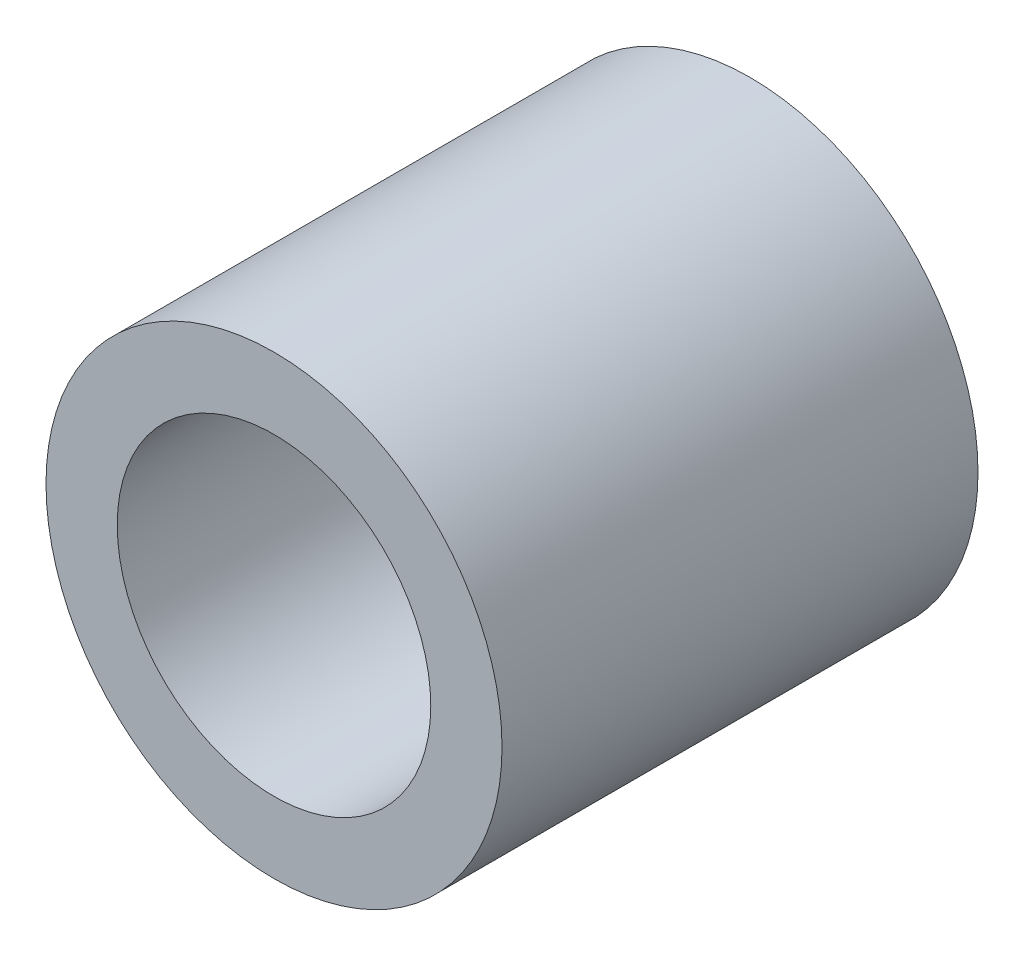
ISO-10303-21;
HEADER;
FILE_DESCRIPTION(('STEP AP214'),'2;1');
FILE_NAME('part.step','',(''),(''),'','','');
FILE_SCHEMA(('AUTOMOTIVE_DESIGN { 1 0 10303 214 1 1 1 1 }'));
ENDSEC;
DATA;
#1=APPLICATION_CONTEXT('core data for automotive mechanical design processes');
#2=APPLICATION_PROTOCOL_DEFINITION('international standard','automotive_design',2000,#1);
#3=PRODUCT_CONTEXT('',#1,'mechanical');
#4=PRODUCT('Part','Part','',(#3));
#5=PRODUCT_RELATED_PRODUCT_CATEGORY('part','',(#4));
#6=PRODUCT_DEFINITION_FORMATION('','',#4);
#7=PRODUCT_DEFINITION_CONTEXT('part definition',#1,'design');
#8=PRODUCT_DEFINITION('design','',#6,#7);
#9=PRODUCT_DEFINITION_SHAPE('','',#8);
#10=(LENGTH_UNIT() NAMED_UNIT(*) SI_UNIT(.MILLI.,.METRE.));
#11=(NAMED_UNIT(*) PLANE_ANGLE_UNIT() SI_UNIT($,.RADIAN.));
#12=(NAMED_UNIT(*) SI_UNIT($,.STERADIAN.) SOLID_ANGLE_UNIT());
#13=UNCERTAINTY_MEASURE_WITH_UNIT(LENGTH_MEASURE(1.E-05),#10,'distance_accuracy_value','');
#14=(GEOMETRIC_REPRESENTATION_CONTEXT(3) GLOBAL_UNCERTAINTY_ASSIGNED_CONTEXT((#13)) GLOBAL_UNIT_ASSIGNED_CONTEXT((#10,
#11,#12)) REPRESENTATION_CONTEXT('',''));
#15=CARTESIAN_POINT('',(0.,0.,0.));
#16=DIRECTION('',(0.,0.,1.));
#17=DIRECTION('',(1.,0.,0.));
#18=AXIS2_PLACEMENT_3D('',#15,#16,#17);
#19=CARTESIAN_POINT('',(0.,0.,0.));
#20=DIRECTION('',(0.,0.,1.));
#21=DIRECTION('',(1.,0.,0.));
#22=AXIS2_PLACEMENT_3D('',#19,#20,#21);
#23=CYLINDRICAL_SURFACE('',#22,2.75);
#24=CARTESIAN_POINT('',(0.,0.,8.35));
#25=DIRECTION('',(0.,0.,1.));
#26=DIRECTION('',(1.,0.,0.));
#27=AXIS2_PLACEMENT_3D('',#24,#25,#26);
#28=CIRCLE('',#27,2.75);
#29=CARTESIAN_POINT('',(2.75,0.,8.35));
#30=VERTEX_POINT('',#29);
#31=EDGE_CURVE('E17',#30,#30,#28,.F.);
#32=ORIENTED_EDGE('',*,*,#31,.F.);
#33=EDGE_LOOP('',(#32));
#34=FACE_BOUND('',#33,.T.);
#35=CARTESIAN_POINT('',(0.,0.,0.));
#36=DIRECTION('',(0.,0.,1.));
#37=DIRECTION('',(1.,0.,0.));
#38=AXIS2_PLACEMENT_3D('',#35,#36,#37);
#39=CIRCLE('',#38,2.75);
#40=CARTESIAN_POINT('',(2.75,0.,0.));
#41=VERTEX_POINT('',#40);
#42=EDGE_CURVE('E26',#41,#41,#39,.F.);
#43=ORIENTED_EDGE('',*,*,#42,.T.);
#44=EDGE_LOOP('',(#43));
#45=FACE_BOUND('',#44,.T.);
#46=ADVANCED_FACE('F14',(#34,#45),#23,.F.);
#47=CARTESIAN_POINT('',(0.,0.,8.35));
#48=DIRECTION('',(0.,0.,1.));
#49=DIRECTION('',(1.,0.,0.));
#50=AXIS2_PLACEMENT_3D('',#47,#48,#49);
#51=PLANE('',#50);
#52=ORIENTED_EDGE('',*,*,#31,.T.);
#53=EDGE_LOOP('',(#52));
#54=FACE_BOUND('',#53,.T.);
#55=CARTESIAN_POINT('',(0.,0.,8.35));
#56=DIRECTION('',(0.,0.,1.));
#57=DIRECTION('',(1.,0.,0.));
#58=AXIS2_PLACEMENT_3D('',#55,#56,#57);
#59=CIRCLE('',#58,4.);
#60=CARTESIAN_POINT('',(4.,0.,8.35));
#61=VERTEX_POINT('',#60);
#62=EDGE_CURVE('E21',#61,#61,#59,.F.);
#63=ORIENTED_EDGE('',*,*,#62,.F.);
#64=EDGE_LOOP('',(#63));
#65=FACE_BOUND('',#64,.T.);
#66=ADVANCED_FACE('F34',(#54,#65),#51,.T.);
#67=CARTESIAN_POINT('',(0.,0.,0.));
#68=DIRECTION('',(0.,0.,1.));
#69=DIRECTION('',(1.,0.,0.));
#70=AXIS2_PLACEMENT_3D('',#67,#68,#69);
#71=PLANE('',#70);
#72=ORIENTED_EDGE('',*,*,#42,.F.);
#73=EDGE_LOOP('',(#72));
#74=FACE_BOUND('',#73,.T.);
#75=CARTESIAN_POINT('',(0.,0.,0.));
#76=DIRECTION('',(0.,0.,1.));
#77=DIRECTION('',(1.,0.,0.));
#78=AXIS2_PLACEMENT_3D('',#75,#76,#77);
#79=CIRCLE('',#78,4.);
#80=CARTESIAN_POINT('',(4.,0.,0.));
#81=VERTEX_POINT('',#80);
#82=EDGE_CURVE('E10',#81,#81,#79,.T.);
#83=ORIENTED_EDGE('',*,*,#82,.F.);
#84=EDGE_LOOP('',(#83));
#85=FACE_BOUND('',#84,.T.);
#86=ADVANCED_FACE('F42',(#74,#85),#71,.F.);
#87=CARTESIAN_POINT('',(0.,0.,0.));
#88=DIRECTION('',(0.,0.,1.));
#89=DIRECTION('',(1.,0.,0.));
#90=AXIS2_PLACEMENT_3D('',#87,#88,#89);
#91=CYLINDRICAL_SURFACE('',#90,4.);
#92=ORIENTED_EDGE('',*,*,#62,.T.);
#93=EDGE_LOOP('',(#92));
#94=FACE_BOUND('',#93,.T.);
#95=ORIENTED_EDGE('',*,*,#82,.T.);
#96=EDGE_LOOP('',(#95));
#97=FACE_BOUND('',#96,.T.);
#98=ADVANCED_FACE('F43',(#94,#97),#91,.T.);
#99=CLOSED_SHELL('',(#46,#66,#86,#98));
#100=MANIFOLD_SOLID_BREP('B1',#99);
#101=ADVANCED_BREP_SHAPE_REPRESENTATION('',(#18,#100),#14);
#102=SHAPE_DEFINITION_REPRESENTATION(#9,#101);
ENDSEC;
END-ISO-10303-21;
